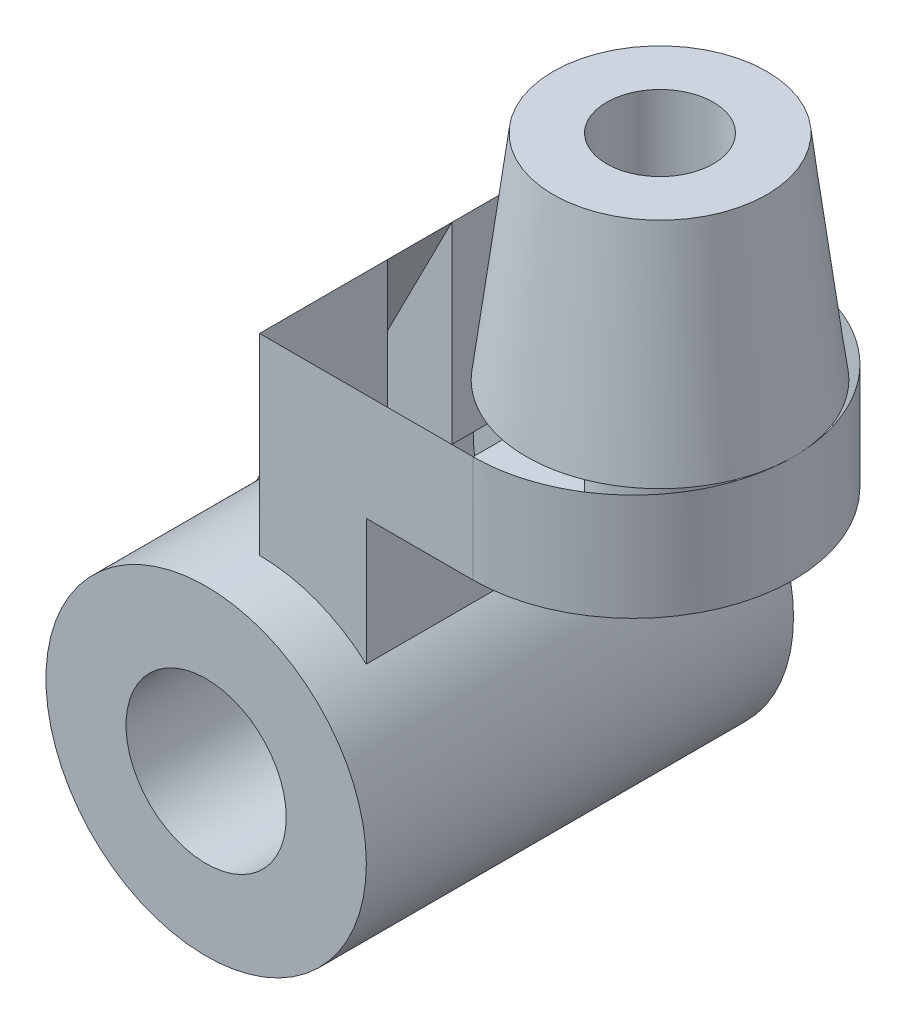
ISO-10303-21;
HEADER;
FILE_DESCRIPTION(('STEP AP214'),'2;1');
FILE_NAME('part.step','',(''),(''),'','','');
FILE_SCHEMA(('AUTOMOTIVE_DESIGN { 1 0 10303 214 1 1 1 1 }'));
ENDSEC;
DATA;
#1=APPLICATION_CONTEXT('core data for automotive mechanical design processes');
#2=APPLICATION_PROTOCOL_DEFINITION('international standard','automotive_design',2000,#1);
#3=PRODUCT_CONTEXT('',#1,'mechanical');
#4=PRODUCT('Part','Part','',(#3));
#5=PRODUCT_RELATED_PRODUCT_CATEGORY('part','',(#4));
#6=PRODUCT_DEFINITION_FORMATION('','',#4);
#7=PRODUCT_DEFINITION_CONTEXT('part definition',#1,'design');
#8=PRODUCT_DEFINITION('design','',#6,#7);
#9=PRODUCT_DEFINITION_SHAPE('','',#8);
#10=(LENGTH_UNIT() NAMED_UNIT(*) SI_UNIT(.MILLI.,.METRE.));
#11=(NAMED_UNIT(*) PLANE_ANGLE_UNIT() SI_UNIT($,.RADIAN.));
#12=(NAMED_UNIT(*) SI_UNIT($,.STERADIAN.) SOLID_ANGLE_UNIT());
#13=UNCERTAINTY_MEASURE_WITH_UNIT(LENGTH_MEASURE(1.E-05),#10,'distance_accuracy_value','');
#14=(GEOMETRIC_REPRESENTATION_CONTEXT(3) GLOBAL_UNCERTAINTY_ASSIGNED_CONTEXT((#13)) GLOBAL_UNIT_ASSIGNED_CONTEXT((#10,
#11,#12)) REPRESENTATION_CONTEXT('',''));
#15=CARTESIAN_POINT('',(0.,0.,0.));
#16=DIRECTION('',(0.,0.,1.));
#17=DIRECTION('',(1.,0.,0.));
#18=AXIS2_PLACEMENT_3D('',#15,#16,#17);
#19=CARTESIAN_POINT('',(0.,30.,30.));
#20=DIRECTION('',(1.,0.,0.));
#21=DIRECTION('',(0.,0.,-1.));
#22=AXIS2_PLACEMENT_3D('',#19,#20,#21);
#23=PLANE('',#22);
#24=DIRECTION('',(0.,1.,0.));
#25=VECTOR('',#24,1.);
#26=CARTESIAN_POINT('',(0.,66.,-6.));
#27=LINE('',#26,#25);
#28=CARTESIAN_POINT('',(0.,30.,-6.));
#29=VERTEX_POINT('',#28);
#30=CARTESIAN_POINT('',(0.,66.,-6.));
#31=VERTEX_POINT('',#30);
#32=EDGE_CURVE('E109',#29,#31,#27,.T.);
#33=ORIENTED_EDGE('',*,*,#32,.T.);
#34=DIRECTION('',(0.,0.,-1.));
#35=VECTOR('',#34,1.);
#36=CARTESIAN_POINT('',(0.,66.,30.));
#37=LINE('',#36,#35);
#38=CARTESIAN_POINT('',(0.,66.,-30.));
#39=VERTEX_POINT('',#38);
#40=EDGE_CURVE('E173',#31,#39,#37,.T.);
#41=ORIENTED_EDGE('',*,*,#40,.T.);
#42=DIRECTION('',(0.,-1.,0.));
#43=VECTOR('',#42,1.);
#44=CARTESIAN_POINT('',(0.,30.,-30.));
#45=LINE('',#44,#43);
#46=CARTESIAN_POINT('',(0.,30.,-30.));
#47=VERTEX_POINT('',#46);
#48=EDGE_CURVE('E112',#39,#47,#45,.T.);
#49=ORIENTED_EDGE('',*,*,#48,.T.);
#50=DIRECTION('',(0.,0.,-1.));
#51=VECTOR('',#50,1.);
#52=CARTESIAN_POINT('',(0.,30.,30.));
#53=LINE('',#52,#51);
#54=EDGE_CURVE('E106',#29,#47,#53,.T.);
#55=ORIENTED_EDGE('',*,*,#54,.F.);
#56=EDGE_LOOP('',(#33,#41,#49,#55));
#57=FACE_BOUND('',#56,.T.);
#58=ADVANCED_FACE('F33',(#57),#23,.F.);
#59=CARTESIAN_POINT('',(0.,0.,40.));
#60=DIRECTION('',(0.,0.,-1.));
#61=DIRECTION('',(-1.,0.,0.));
#62=AXIS2_PLACEMENT_3D('',#59,#60,#61);
#63=CYLINDRICAL_SURFACE('',#62,30.);
#64=CARTESIAN_POINT('',(0.,0.,-40.));
#65=DIRECTION('',(0.,0.,1.));
#66=DIRECTION('',(1.,0.,0.));
#67=AXIS2_PLACEMENT_3D('',#64,#65,#66);
#68=CIRCLE('',#67,30.);
#69=CARTESIAN_POINT('',(30.,0.,-40.));
#70=VERTEX_POINT('',#69);
#71=EDGE_CURVE('E37',#70,#70,#68,.T.);
#72=ORIENTED_EDGE('',*,*,#71,.T.);
#73=EDGE_LOOP('',(#72));
#74=FACE_BOUND('',#73,.T.);
#75=CARTESIAN_POINT('',(0.,0.,40.));
#76=DIRECTION('',(0.,0.,1.));
#77=DIRECTION('',(1.,0.,0.));
#78=AXIS2_PLACEMENT_3D('',#75,#76,#77);
#79=CIRCLE('',#78,30.);
#80=CARTESIAN_POINT('',(30.,0.,40.));
#81=VERTEX_POINT('',#80);
#82=EDGE_CURVE('E11',#81,#81,#79,.T.);
#83=ORIENTED_EDGE('',*,*,#82,.F.);
#84=EDGE_LOOP('',(#83));
#85=FACE_BOUND('',#84,.T.);
#86=CARTESIAN_POINT('',(0.,30.,30.));
#87=VERTEX_POINT('',#86);
#88=CARTESIAN_POINT('',(0.,30.,6.));
#89=VERTEX_POINT('',#88);
#90=EDGE_CURVE('E115',#87,#89,#53,.T.);
#91=ORIENTED_EDGE('',*,*,#90,.T.);
#92=CARTESIAN_POINT('',(0.,0.,6.));
#93=DIRECTION('',(0.,0.,-1.));
#94=DIRECTION('',(1.,0.,0.));
#95=AXIS2_PLACEMENT_3D('',#92,#93,#94);
#96=CIRCLE('',#95,30.);
#97=CARTESIAN_POINT('',(-26.7217062849074,13.6363636363636,6.));
#98=VERTEX_POINT('',#97);
#99=EDGE_CURVE('E53',#98,#89,#96,.T.);
#100=ORIENTED_EDGE('',*,*,#99,.F.);
#101=DIRECTION('',(0.,0.,-1.));
#102=VECTOR('',#101,1.);
#103=CARTESIAN_POINT('',(-26.7217062849074,13.6363636363636,6.));
#104=LINE('',#103,#102);
#105=CARTESIAN_POINT('',(-26.7217062849074,13.6363636363636,-6.));
#106=VERTEX_POINT('',#105);
#107=EDGE_CURVE('E121',#98,#106,#104,.T.);
#108=ORIENTED_EDGE('',*,*,#107,.T.);
#109=CARTESIAN_POINT('',(0.,0.,-6.));
#110=DIRECTION('',(0.,0.,-1.));
#111=DIRECTION('',(1.,0.,0.));
#112=AXIS2_PLACEMENT_3D('',#109,#110,#111);
#113=CIRCLE('',#112,30.);
#114=EDGE_CURVE('E119',#106,#29,#113,.T.);
#115=ORIENTED_EDGE('',*,*,#114,.T.);
#116=ORIENTED_EDGE('',*,*,#54,.T.);
#117=CARTESIAN_POINT('',(0.,0.,-30.));
#118=DIRECTION('',(0.,0.,-1.));
#119=DIRECTION('',(-1.,0.,0.));
#120=AXIS2_PLACEMENT_3D('',#117,#118,#119);
#121=CIRCLE('',#120,30.0000000000001);
#122=CARTESIAN_POINT('',(20.,22.3606797749979,-30.));
#123=VERTEX_POINT('',#122);
#124=EDGE_CURVE('E145',#47,#123,#121,.T.);
#125=ORIENTED_EDGE('',*,*,#124,.T.);
#126=DIRECTION('',(0.,0.,-1.));
#127=VECTOR('',#126,1.);
#128=CARTESIAN_POINT('',(20.,22.3606797749979,30.));
#129=LINE('',#128,#127);
#130=CARTESIAN_POINT('',(20.,22.3606797749979,30.));
#131=VERTEX_POINT('',#130);
#132=EDGE_CURVE('E180',#131,#123,#129,.T.);
#133=ORIENTED_EDGE('',*,*,#132,.F.);
#134=CARTESIAN_POINT('',(0.,0.,30.));
#135=DIRECTION('',(0.,0.,-1.));
#136=DIRECTION('',(-1.,0.,0.));
#137=AXIS2_PLACEMENT_3D('',#134,#135,#136);
#138=CIRCLE('',#137,30.0000000000001);
#139=EDGE_CURVE('E149',#87,#131,#138,.T.);
#140=ORIENTED_EDGE('',*,*,#139,.F.);
#141=EDGE_LOOP('',(#91,#100,#108,#115,#116,#125,#133,#140));
#142=FACE_BOUND('',#141,.T.);
#143=ADVANCED_FACE('F35',(#74,#85,#142),#63,.T.);
#144=CARTESIAN_POINT('',(0.,0.,40.));
#145=DIRECTION('',(0.,0.,1.));
#146=DIRECTION('',(1.,0.,0.));
#147=AXIS2_PLACEMENT_3D('',#144,#145,#146);
#148=PLANE('',#147);
#149=ORIENTED_EDGE('',*,*,#82,.T.);
#150=EDGE_LOOP('',(#149));
#151=FACE_BOUND('',#150,.T.);
#152=CARTESIAN_POINT('',(0.,0.,40.));
#153=DIRECTION('',(0.,0.,1.));
#154=DIRECTION('',(1.,0.,0.));
#155=AXIS2_PLACEMENT_3D('',#152,#153,#154);
#156=CIRCLE('',#155,15.);
#157=CARTESIAN_POINT('',(15.,0.,40.));
#158=VERTEX_POINT('',#157);
#159=EDGE_CURVE('E183',#158,#158,#156,.T.);
#160=ORIENTED_EDGE('',*,*,#159,.F.);
#161=EDGE_LOOP('',(#160));
#162=FACE_BOUND('',#161,.T.);
#163=ADVANCED_FACE('F203',(#151,#162),#148,.T.);
#164=CARTESIAN_POINT('',(0.,0.,-40.));
#165=DIRECTION('',(0.,0.,1.));
#166=DIRECTION('',(1.,0.,0.));
#167=AXIS2_PLACEMENT_3D('',#164,#165,#166);
#168=PLANE('',#167);
#169=ORIENTED_EDGE('',*,*,#71,.F.);
#170=EDGE_LOOP('',(#169));
#171=FACE_BOUND('',#170,.T.);
#172=CARTESIAN_POINT('',(0.,0.,-40.));
#173=DIRECTION('',(0.,0.,1.));
#174=DIRECTION('',(1.,0.,0.));
#175=AXIS2_PLACEMENT_3D('',#172,#173,#174);
#176=CIRCLE('',#175,15.);
#177=CARTESIAN_POINT('',(15.,0.,-40.));
#178=VERTEX_POINT('',#177);
#179=EDGE_CURVE('E182',#178,#178,#176,.T.);
#180=ORIENTED_EDGE('',*,*,#179,.T.);
#181=EDGE_LOOP('',(#180));
#182=FACE_BOUND('',#181,.T.);
#183=ADVANCED_FACE('F189',(#171,#182),#168,.F.);
#184=CARTESIAN_POINT('',(0.,0.,40.));
#185=DIRECTION('',(0.,0.,-1.));
#186=DIRECTION('',(-1.,0.,0.));
#187=AXIS2_PLACEMENT_3D('',#184,#185,#186);
#188=CYLINDRICAL_SURFACE('',#187,15.);
#189=ORIENTED_EDGE('',*,*,#159,.T.);
#190=EDGE_LOOP('',(#189));
#191=FACE_BOUND('',#190,.T.);
#192=ORIENTED_EDGE('',*,*,#179,.F.);
#193=EDGE_LOOP('',(#192));
#194=FACE_BOUND('',#193,.T.);
#195=ADVANCED_FACE('F191',(#191,#194),#188,.F.);
#196=CARTESIAN_POINT('',(20.,46.,30.));
#197=DIRECTION('',(-1.,0.,0.));
#198=DIRECTION('',(0.,0.,1.));
#199=AXIS2_PLACEMENT_3D('',#196,#197,#198);
#200=PLANE('',#199);
#201=DIRECTION('',(0.,1.,0.));
#202=VECTOR('',#201,1.);
#203=CARTESIAN_POINT('',(20.,46.,-30.));
#204=LINE('',#203,#202);
#205=CARTESIAN_POINT('',(20.,46.,-30.));
#206=VERTEX_POINT('',#205);
#207=EDGE_CURVE('E162',#123,#206,#204,.T.);
#208=ORIENTED_EDGE('',*,*,#207,.T.);
#209=DIRECTION('',(0.,0.,-1.));
#210=VECTOR('',#209,1.);
#211=CARTESIAN_POINT('',(20.,46.,30.));
#212=LINE('',#211,#210);
#213=CARTESIAN_POINT('',(20.,46.,30.));
#214=VERTEX_POINT('',#213);
#215=EDGE_CURVE('E177',#214,#206,#212,.T.);
#216=ORIENTED_EDGE('',*,*,#215,.F.);
#217=DIRECTION('',(0.,1.,0.));
#218=VECTOR('',#217,1.);
#219=CARTESIAN_POINT('',(20.,46.,30.));
#220=LINE('',#219,#218);
#221=EDGE_CURVE('E152',#131,#214,#220,.T.);
#222=ORIENTED_EDGE('',*,*,#221,.F.);
#223=ORIENTED_EDGE('',*,*,#132,.T.);
#224=EDGE_LOOP('',(#208,#216,#222,#223));
#225=FACE_BOUND('',#224,.T.);
#226=ADVANCED_FACE('F193',(#225),#200,.F.);
#227=CARTESIAN_POINT('',(40.,46.,30.));
#228=DIRECTION('',(0.,1.,0.));
#229=DIRECTION('',(0.,0.,1.));
#230=AXIS2_PLACEMENT_3D('',#227,#228,#229);
#231=PLANE('',#230);
#232=CARTESIAN_POINT('',(45.,46.,0.));
#233=DIRECTION('',(0.,1.,0.));
#234=DIRECTION('',(0.,0.,1.));
#235=AXIS2_PLACEMENT_3D('',#232,#233,#234);
#236=CIRCLE('',#235,10.);
#237=CARTESIAN_POINT('',(45.,46.,10.));
#238=VERTEX_POINT('',#237);
#239=EDGE_CURVE('E241',#238,#238,#236,.T.);
#240=ORIENTED_EDGE('',*,*,#239,.T.);
#241=EDGE_LOOP('',(#240));
#242=FACE_BOUND('',#241,.T.);
#243=DIRECTION('',(1.,0.,0.));
#244=VECTOR('',#243,1.);
#245=CARTESIAN_POINT('',(40.,46.,-30.));
#246=LINE('',#245,#244);
#247=CARTESIAN_POINT('',(40.,46.,-30.));
#248=VERTEX_POINT('',#247);
#249=EDGE_CURVE('E164',#206,#248,#246,.T.);
#250=ORIENTED_EDGE('',*,*,#249,.T.);
#251=CARTESIAN_POINT('',(40.,46.,0.));
#252=DIRECTION('',(0.,1.,0.));
#253=DIRECTION('',(0.,0.,-1.));
#254=AXIS2_PLACEMENT_3D('',#251,#252,#253);
#255=CIRCLE('',#254,30.);
#256=CARTESIAN_POINT('',(40.,46.,30.));
#257=VERTEX_POINT('',#256);
#258=EDGE_CURVE('E142',#257,#248,#255,.T.);
#259=ORIENTED_EDGE('',*,*,#258,.F.);
#260=DIRECTION('',(1.,0.,0.));
#261=VECTOR('',#260,1.);
#262=CARTESIAN_POINT('',(40.,46.,30.));
#263=LINE('',#262,#261);
#264=EDGE_CURVE('E154',#214,#257,#263,.T.);
#265=ORIENTED_EDGE('',*,*,#264,.F.);
#266=ORIENTED_EDGE('',*,*,#215,.T.);
#267=EDGE_LOOP('',(#250,#259,#265,#266));
#268=FACE_BOUND('',#267,.T.);
#269=ADVANCED_FACE('F200',(#242,#268),#231,.F.);
#270=CARTESIAN_POINT('',(0.,66.,30.));
#271=DIRECTION('',(0.,-1.,0.));
#272=DIRECTION('',(0.,0.,-1.));
#273=AXIS2_PLACEMENT_3D('',#270,#271,#272);
#274=PLANE('',#273);
#275=CARTESIAN_POINT('',(40.,66.,0.));
#276=DIRECTION('',(0.,1.,0.));
#277=DIRECTION('',(0.,0.,-1.));
#278=AXIS2_PLACEMENT_3D('',#275,#276,#277);
#279=CIRCLE('',#278,30.);
#280=CARTESIAN_POINT('',(40.,66.,30.));
#281=VERTEX_POINT('',#280);
#282=CARTESIAN_POINT('',(70.,66.,0.));
#283=VERTEX_POINT('',#282);
#284=EDGE_CURVE('E146',#281,#283,#279,.T.);
#285=ORIENTED_EDGE('',*,*,#284,.T.);
#286=CARTESIAN_POINT('',(45.,66.,0.));
#287=DIRECTION('',(0.,-1.,0.));
#288=DIRECTION('',(0.,0.,-1.));
#289=AXIS2_PLACEMENT_3D('',#286,#287,#288);
#290=CIRCLE('',#289,25.);
#291=EDGE_CURVE('E46',#283,#283,#290,.T.);
#292=ORIENTED_EDGE('',*,*,#291,.T.);
#293=CARTESIAN_POINT('',(40.,66.,-30.));
#294=VERTEX_POINT('',#293);
#295=EDGE_CURVE('E141',#283,#294,#279,.T.);
#296=ORIENTED_EDGE('',*,*,#295,.T.);
#297=DIRECTION('',(-1.,0.,0.));
#298=VECTOR('',#297,1.);
#299=CARTESIAN_POINT('',(0.,66.,-30.));
#300=LINE('',#299,#298);
#301=EDGE_CURVE('E169',#294,#39,#300,.T.);
#302=ORIENTED_EDGE('',*,*,#301,.T.);
#303=ORIENTED_EDGE('',*,*,#40,.F.);
#304=DIRECTION('',(0.,0.,-1.));
#305=VECTOR('',#304,1.);
#306=CARTESIAN_POINT('',(0.,66.,6.));
#307=LINE('',#306,#305);
#308=CARTESIAN_POINT('',(0.,66.,6.));
#309=VERTEX_POINT('',#308);
#310=EDGE_CURVE('E139',#309,#31,#307,.T.);
#311=ORIENTED_EDGE('',*,*,#310,.F.);
#312=CARTESIAN_POINT('',(0.,66.,30.));
#313=VERTEX_POINT('',#312);
#314=EDGE_CURVE('E174',#313,#309,#37,.T.);
#315=ORIENTED_EDGE('',*,*,#314,.F.);
#316=DIRECTION('',(-1.,0.,0.));
#317=VECTOR('',#316,1.);
#318=CARTESIAN_POINT('',(0.,66.,30.));
#319=LINE('',#318,#317);
#320=EDGE_CURVE('E158',#281,#313,#319,.T.);
#321=ORIENTED_EDGE('',*,*,#320,.F.);
#322=EDGE_LOOP('',(#285,#292,#296,#302,#303,#311,#315,#321));
#323=FACE_BOUND('',#322,.T.);
#324=ADVANCED_FACE('F217',(#323),#274,.F.);
#325=ORIENTED_EDGE('',*,*,#314,.T.);
#326=DIRECTION('',(0.,1.,0.));
#327=VECTOR('',#326,1.);
#328=CARTESIAN_POINT('',(0.,66.,6.));
#329=LINE('',#328,#327);
#330=EDGE_CURVE('E125',#89,#309,#329,.T.);
#331=ORIENTED_EDGE('',*,*,#330,.F.);
#332=ORIENTED_EDGE('',*,*,#90,.F.);
#333=DIRECTION('',(0.,-1.,0.));
#334=VECTOR('',#333,1.);
#335=CARTESIAN_POINT('',(0.,30.,30.));
#336=LINE('',#335,#334);
#337=EDGE_CURVE('E116',#313,#87,#336,.T.);
#338=ORIENTED_EDGE('',*,*,#337,.F.);
#339=EDGE_LOOP('',(#325,#331,#332,#338));
#340=FACE_BOUND('',#339,.T.);
#341=ADVANCED_FACE('F208',(#340),#23,.F.);
#342=CARTESIAN_POINT('',(0.,0.,30.));
#343=DIRECTION('',(0.,0.,-1.));
#344=DIRECTION('',(-1.,0.,0.));
#345=AXIS2_PLACEMENT_3D('',#342,#343,#344);
#346=PLANE('',#345);
#347=ORIENTED_EDGE('',*,*,#139,.T.);
#348=ORIENTED_EDGE('',*,*,#221,.T.);
#349=ORIENTED_EDGE('',*,*,#264,.T.);
#350=DIRECTION('',(0.,1.,0.));
#351=VECTOR('',#350,1.);
#352=CARTESIAN_POINT('',(40.,66.,30.));
#353=LINE('',#352,#351);
#354=EDGE_CURVE('E156',#257,#281,#353,.T.);
#355=ORIENTED_EDGE('',*,*,#354,.T.);
#356=ORIENTED_EDGE('',*,*,#320,.T.);
#357=ORIENTED_EDGE('',*,*,#337,.T.);
#358=EDGE_LOOP('',(#347,#348,#349,#355,#356,#357));
#359=FACE_BOUND('',#358,.T.);
#360=ADVANCED_FACE('F216',(#359),#346,.F.);
#361=CARTESIAN_POINT('',(0.,0.,-30.));
#362=DIRECTION('',(0.,0.,-1.));
#363=DIRECTION('',(-1.,0.,0.));
#364=AXIS2_PLACEMENT_3D('',#361,#362,#363);
#365=PLANE('',#364);
#366=ORIENTED_EDGE('',*,*,#124,.F.);
#367=ORIENTED_EDGE('',*,*,#48,.F.);
#368=ORIENTED_EDGE('',*,*,#301,.F.);
#369=DIRECTION('',(0.,1.,0.));
#370=VECTOR('',#369,1.);
#371=CARTESIAN_POINT('',(40.,66.,-30.));
#372=LINE('',#371,#370);
#373=EDGE_CURVE('E166',#248,#294,#372,.T.);
#374=ORIENTED_EDGE('',*,*,#373,.F.);
#375=ORIENTED_EDGE('',*,*,#249,.F.);
#376=ORIENTED_EDGE('',*,*,#207,.F.);
#377=EDGE_LOOP('',(#366,#367,#368,#374,#375,#376));
#378=FACE_BOUND('',#377,.T.);
#379=ADVANCED_FACE('F223',(#378),#365,.T.);
#380=CARTESIAN_POINT('',(40.,46.,0.));
#381=DIRECTION('',(0.,1.,0.));
#382=DIRECTION('',(0.,0.,1.));
#383=AXIS2_PLACEMENT_3D('',#380,#381,#382);
#384=CYLINDRICAL_SURFACE('',#383,30.);
#385=ORIENTED_EDGE('',*,*,#284,.F.);
#386=ORIENTED_EDGE('',*,*,#354,.F.);
#387=ORIENTED_EDGE('',*,*,#258,.T.);
#388=ORIENTED_EDGE('',*,*,#373,.T.);
#389=ORIENTED_EDGE('',*,*,#295,.F.);
#390=EDGE_LOOP('',(#385,#386,#387,#388,#389));
#391=FACE_BOUND('',#390,.T.);
#392=ADVANCED_FACE('F274',(#391),#384,.T.);
#393=CARTESIAN_POINT('',(0.,66.,6.));
#394=DIRECTION('',(0.890723542830247,-0.454545454545455,0.));
#395=DIRECTION('',(0.454545454545455,0.890723542830247,0.));
#396=AXIS2_PLACEMENT_3D('',#393,#394,#395);
#397=PLANE('',#396);
#398=DIRECTION('',(-0.454545454545455,-0.890723542830247,0.));
#399=VECTOR('',#398,1.);
#400=CARTESIAN_POINT('',(0.,66.,-6.));
#401=LINE('',#400,#399);
#402=EDGE_CURVE('E126',#31,#106,#401,.T.);
#403=ORIENTED_EDGE('',*,*,#402,.T.);
#404=ORIENTED_EDGE('',*,*,#107,.F.);
#405=DIRECTION('',(-0.454545454545455,-0.890723542830247,0.));
#406=VECTOR('',#405,1.);
#407=CARTESIAN_POINT('',(0.,66.,6.));
#408=LINE('',#407,#406);
#409=EDGE_CURVE('E234',#309,#98,#408,.T.);
#410=ORIENTED_EDGE('',*,*,#409,.F.);
#411=ORIENTED_EDGE('',*,*,#310,.T.);
#412=EDGE_LOOP('',(#403,#404,#410,#411));
#413=FACE_BOUND('',#412,.T.);
#414=ADVANCED_FACE('F235',(#413),#397,.F.);
#415=CARTESIAN_POINT('',(0.,0.,6.));
#416=DIRECTION('',(0.,0.,1.));
#417=DIRECTION('',(1.,0.,0.));
#418=AXIS2_PLACEMENT_3D('',#415,#416,#417);
#419=PLANE('',#418);
#420=ORIENTED_EDGE('',*,*,#330,.T.);
#421=ORIENTED_EDGE('',*,*,#409,.T.);
#422=ORIENTED_EDGE('',*,*,#99,.T.);
#423=EDGE_LOOP('',(#420,#421,#422));
#424=FACE_BOUND('',#423,.T.);
#425=ADVANCED_FACE('F237',(#424),#419,.T.);
#426=CARTESIAN_POINT('',(0.,0.,-6.));
#427=DIRECTION('',(0.,0.,1.));
#428=DIRECTION('',(1.,0.,0.));
#429=AXIS2_PLACEMENT_3D('',#426,#427,#428);
#430=PLANE('',#429);
#431=ORIENTED_EDGE('',*,*,#32,.F.);
#432=ORIENTED_EDGE('',*,*,#114,.F.);
#433=ORIENTED_EDGE('',*,*,#402,.F.);
#434=EDGE_LOOP('',(#431,#432,#433));
#435=FACE_BOUND('',#434,.T.);
#436=ADVANCED_FACE('F128',(#435),#430,.F.);
#437=CARTESIAN_POINT('',(45.,106.,0.));
#438=DIRECTION('',(0.,-1.,0.));
#439=DIRECTION('',(0.,0.,-1.));
#440=AXIS2_PLACEMENT_3D('',#437,#438,#439);
#441=CONICAL_SURFACE('',#440,20.,0.124354994546761);
#442=ORIENTED_EDGE('',*,*,#291,.F.);
#443=EDGE_LOOP('',(#442));
#444=FACE_BOUND('',#443,.T.);
#445=CARTESIAN_POINT('',(45.,106.,0.));
#446=DIRECTION('',(0.,-1.,0.));
#447=DIRECTION('',(0.,0.,-1.));
#448=AXIS2_PLACEMENT_3D('',#445,#446,#447);
#449=CIRCLE('',#448,20.);
#450=CARTESIAN_POINT('',(45.,106.,-20.));
#451=VERTEX_POINT('',#450);
#452=EDGE_CURVE('E130',#451,#451,#449,.T.);
#453=ORIENTED_EDGE('',*,*,#452,.T.);
#454=EDGE_LOOP('',(#453));
#455=FACE_BOUND('',#454,.T.);
#456=ADVANCED_FACE('F259',(#444,#455),#441,.T.);
#457=CARTESIAN_POINT('',(25.,106.,0.));
#458=DIRECTION('',(0.,-1.,0.));
#459=DIRECTION('',(0.,0.,-1.));
#460=AXIS2_PLACEMENT_3D('',#457,#458,#459);
#461=PLANE('',#460);
#462=CARTESIAN_POINT('',(45.,106.,0.));
#463=DIRECTION('',(0.,1.,0.));
#464=DIRECTION('',(0.,0.,1.));
#465=AXIS2_PLACEMENT_3D('',#462,#463,#464);
#466=CIRCLE('',#465,10.);
#467=CARTESIAN_POINT('',(45.,106.,10.));
#468=VERTEX_POINT('',#467);
#469=EDGE_CURVE('E242',#468,#468,#466,.T.);
#470=ORIENTED_EDGE('',*,*,#469,.F.);
#471=EDGE_LOOP('',(#470));
#472=FACE_BOUND('',#471,.T.);
#473=ORIENTED_EDGE('',*,*,#452,.F.);
#474=EDGE_LOOP('',(#473));
#475=FACE_BOUND('',#474,.T.);
#476=ADVANCED_FACE('F253',(#472,#475),#461,.F.);
#477=CARTESIAN_POINT('',(45.,46.,0.));
#478=DIRECTION('',(0.,1.,0.));
#479=DIRECTION('',(0.,0.,1.));
#480=AXIS2_PLACEMENT_3D('',#477,#478,#479);
#481=CYLINDRICAL_SURFACE('',#480,10.);
#482=ORIENTED_EDGE('',*,*,#239,.F.);
#483=EDGE_LOOP('',(#482));
#484=FACE_BOUND('',#483,.T.);
#485=ORIENTED_EDGE('',*,*,#469,.T.);
#486=EDGE_LOOP('',(#485));
#487=FACE_BOUND('',#486,.T.);
#488=ADVANCED_FACE('F250',(#484,#487),#481,.F.);
#489=CLOSED_SHELL('',(#58,#143,#163,#183,#195,#226,#269,#324,#341,#360,#379,#392,#414,#425,#436,
#456,#476,#488));
#490=MANIFOLD_SOLID_BREP('B2',#489);
#491=ADVANCED_BREP_SHAPE_REPRESENTATION('',(#18,#490),#14);
#492=SHAPE_DEFINITION_REPRESENTATION(#9,#491);
ENDSEC;
END-ISO-10303-21;
